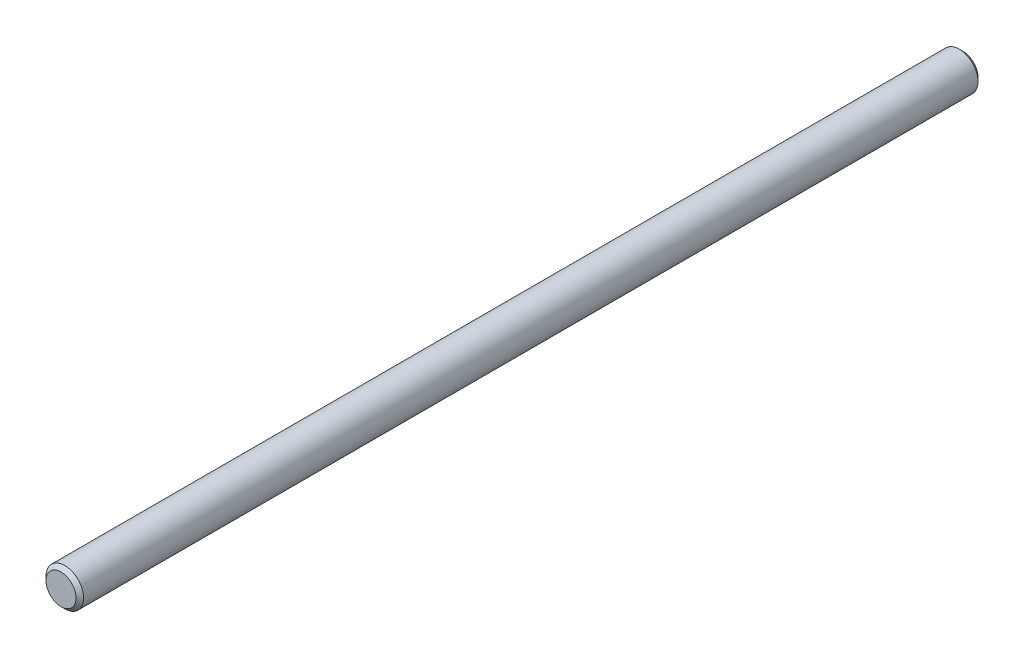
ISO-10303-21;
HEADER;
FILE_DESCRIPTION(('STEP AP214'),'2;1');
FILE_NAME('part.step','',(''),(''),'','','');
FILE_SCHEMA(('AUTOMOTIVE_DESIGN { 1 0 10303 214 1 1 1 1 }'));
ENDSEC;
DATA;
#1=APPLICATION_CONTEXT('core data for automotive mechanical design processes');
#2=APPLICATION_PROTOCOL_DEFINITION('international standard','automotive_design',2000,#1);
#3=PRODUCT_CONTEXT('',#1,'mechanical');
#4=PRODUCT('Part','Part','',(#3));
#5=PRODUCT_RELATED_PRODUCT_CATEGORY('part','',(#4));
#6=PRODUCT_DEFINITION_FORMATION('','',#4);
#7=PRODUCT_DEFINITION_CONTEXT('part definition',#1,'design');
#8=PRODUCT_DEFINITION('design','',#6,#7);
#9=PRODUCT_DEFINITION_SHAPE('','',#8);
#10=(LENGTH_UNIT() NAMED_UNIT(*) SI_UNIT(.MILLI.,.METRE.));
#11=(NAMED_UNIT(*) PLANE_ANGLE_UNIT() SI_UNIT($,.RADIAN.));
#12=(NAMED_UNIT(*) SI_UNIT($,.STERADIAN.) SOLID_ANGLE_UNIT());
#13=UNCERTAINTY_MEASURE_WITH_UNIT(LENGTH_MEASURE(1.E-05),#10,'distance_accuracy_value','');
#14=(GEOMETRIC_REPRESENTATION_CONTEXT(3) GLOBAL_UNCERTAINTY_ASSIGNED_CONTEXT((#13)) GLOBAL_UNIT_ASSIGNED_CONTEXT((#10,
#11,#12)) REPRESENTATION_CONTEXT('',''));
#15=CARTESIAN_POINT('',(0.,0.,0.));
#16=DIRECTION('',(0.,0.,1.));
#17=DIRECTION('',(1.,0.,0.));
#18=AXIS2_PLACEMENT_3D('',#15,#16,#17);
#19=CARTESIAN_POINT('',(0.,0.,76.2));
#20=DIRECTION('',(0.,0.,-1.));
#21=DIRECTION('',(-1.,0.,0.));
#22=AXIS2_PLACEMENT_3D('',#19,#20,#21);
#23=CYLINDRICAL_SURFACE('',#22,3.175);
#24=CARTESIAN_POINT('',(0.,0.,-75.5649999999999));
#25=DIRECTION('',(0.,0.,1.));
#26=DIRECTION('',(1.,0.,0.));
#27=AXIS2_PLACEMENT_3D('',#24,#25,#26);
#28=CIRCLE('',#27,3.175);
#29=CARTESIAN_POINT('',(3.175,0.,-75.5649999999999));
#30=VERTEX_POINT('',#29);
#31=EDGE_CURVE('E48',#30,#30,#28,.T.);
#32=ORIENTED_EDGE('',*,*,#31,.T.);
#33=EDGE_LOOP('',(#32));
#34=FACE_BOUND('',#33,.T.);
#35=CARTESIAN_POINT('',(0.,0.,75.5650000000001));
#36=DIRECTION('',(0.,0.,1.));
#37=DIRECTION('',(1.,0.,0.));
#38=AXIS2_PLACEMENT_3D('',#35,#36,#37);
#39=CIRCLE('',#38,3.175);
#40=CARTESIAN_POINT('',(3.175,0.,75.5650000000001));
#41=VERTEX_POINT('',#40);
#42=EDGE_CURVE('E52',#41,#41,#39,.F.);
#43=ORIENTED_EDGE('',*,*,#42,.T.);
#44=EDGE_LOOP('',(#43));
#45=FACE_BOUND('',#44,.T.);
#46=ADVANCED_FACE('F37',(#34,#45),#23,.T.);
#47=CARTESIAN_POINT('',(0.,0.,76.2));
#48=DIRECTION('',(0.,0.,1.));
#49=DIRECTION('',(1.,0.,0.));
#50=AXIS2_PLACEMENT_3D('',#47,#48,#49);
#51=PLANE('',#50);
#52=CARTESIAN_POINT('',(0.,0.,76.2));
#53=DIRECTION('',(0.,0.,1.));
#54=DIRECTION('',(1.,0.,0.));
#55=AXIS2_PLACEMENT_3D('',#52,#53,#54);
#56=CIRCLE('',#55,2.54000000000008);
#57=CARTESIAN_POINT('',(2.54000000000008,0.,76.2));
#58=VERTEX_POINT('',#57);
#59=EDGE_CURVE('E10',#58,#58,#56,.T.);
#60=ORIENTED_EDGE('',*,*,#59,.T.);
#61=EDGE_LOOP('',(#60));
#62=FACE_BOUND('',#61,.T.);
#63=ADVANCED_FACE('F68',(#62),#51,.T.);
#64=CARTESIAN_POINT('',(0.,0.,-76.2));
#65=DIRECTION('',(0.,0.,1.));
#66=DIRECTION('',(1.,0.,0.));
#67=AXIS2_PLACEMENT_3D('',#64,#65,#66);
#68=PLANE('',#67);
#69=CARTESIAN_POINT('',(0.,0.,-76.2));
#70=DIRECTION('',(0.,0.,1.));
#71=DIRECTION('',(1.,0.,0.));
#72=AXIS2_PLACEMENT_3D('',#69,#70,#71);
#73=CIRCLE('',#72,2.53999999999988);
#74=CARTESIAN_POINT('',(2.53999999999988,0.,-76.2));
#75=VERTEX_POINT('',#74);
#76=EDGE_CURVE('E44',#75,#75,#73,.F.);
#77=ORIENTED_EDGE('',*,*,#76,.T.);
#78=EDGE_LOOP('',(#77));
#79=FACE_BOUND('',#78,.T.);
#80=ADVANCED_FACE('F65',(#79),#68,.F.);
#81=CARTESIAN_POINT('',(0.,0.,-75.5649999999999));
#82=DIRECTION('',(0.,0.,1.));
#83=DIRECTION('',(1.,0.,0.));
#84=AXIS2_PLACEMENT_3D('',#81,#82,#83);
#85=CONICAL_SURFACE('',#84,3.175,0.78539816339744);
#86=ORIENTED_EDGE('',*,*,#76,.F.);
#87=EDGE_LOOP('',(#86));
#88=FACE_BOUND('',#87,.T.);
#89=ORIENTED_EDGE('',*,*,#31,.F.);
#90=EDGE_LOOP('',(#89));
#91=FACE_BOUND('',#90,.T.);
#92=ADVANCED_FACE('F61',(#88,#91),#85,.T.);
#93=CARTESIAN_POINT('',(0.,0.,76.2));
#94=DIRECTION('',(0.,0.,-1.));
#95=DIRECTION('',(-1.,0.,0.));
#96=AXIS2_PLACEMENT_3D('',#93,#94,#95);
#97=CONICAL_SURFACE('',#96,2.54000000000008,0.785398163397451);
#98=ORIENTED_EDGE('',*,*,#42,.F.);
#99=EDGE_LOOP('',(#98));
#100=FACE_BOUND('',#99,.T.);
#101=ORIENTED_EDGE('',*,*,#59,.F.);
#102=EDGE_LOOP('',(#101));
#103=FACE_BOUND('',#102,.T.);
#104=ADVANCED_FACE('F39',(#100,#103),#97,.T.);
#105=CLOSED_SHELL('',(#46,#63,#80,#92,#104));
#106=MANIFOLD_SOLID_BREP('B2',#105);
#107=ADVANCED_BREP_SHAPE_REPRESENTATION('',(#18,#106),#14);
#108=SHAPE_DEFINITION_REPRESENTATION(#9,#107);
ENDSEC;
END-ISO-10303-21;
